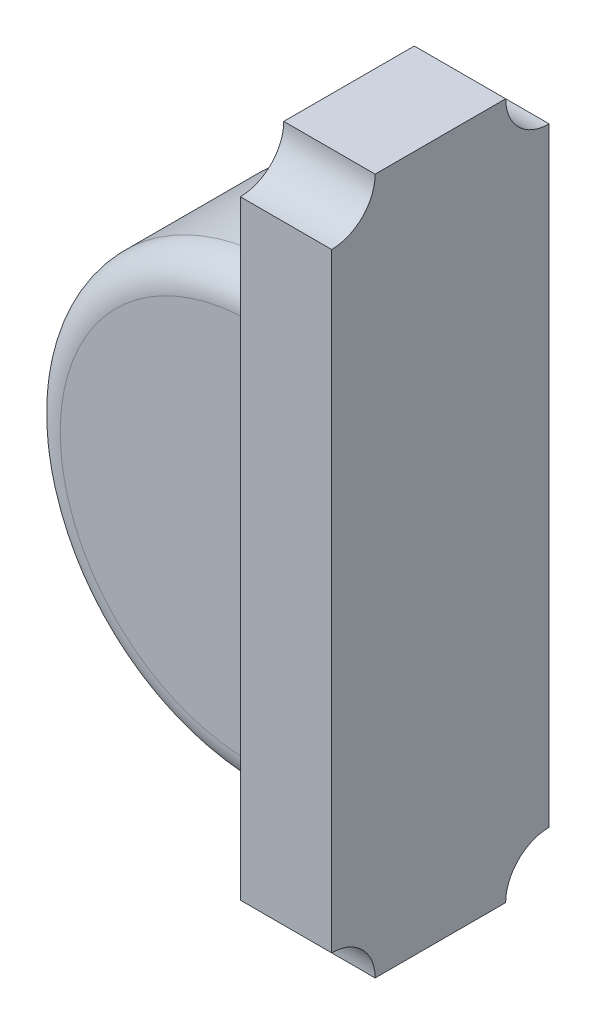
ISO-10303-21;
HEADER;
FILE_DESCRIPTION(('STEP AP214'),'2;1');
FILE_NAME('part.step','',(''),(''),'','','');
FILE_SCHEMA(('AUTOMOTIVE_DESIGN { 1 0 10303 214 1 1 1 1 }'));
ENDSEC;
DATA;
#1=APPLICATION_CONTEXT('core data for automotive mechanical design processes');
#2=APPLICATION_PROTOCOL_DEFINITION('international standard','automotive_design',2000,#1);
#3=PRODUCT_CONTEXT('',#1,'mechanical');
#4=PRODUCT('Part','Part','',(#3));
#5=PRODUCT_RELATED_PRODUCT_CATEGORY('part','',(#4));
#6=PRODUCT_DEFINITION_FORMATION('','',#4);
#7=PRODUCT_DEFINITION_CONTEXT('part definition',#1,'design');
#8=PRODUCT_DEFINITION('design','',#6,#7);
#9=PRODUCT_DEFINITION_SHAPE('','',#8);
#10=(LENGTH_UNIT() NAMED_UNIT(*) SI_UNIT(.MILLI.,.METRE.));
#11=(NAMED_UNIT(*) PLANE_ANGLE_UNIT() SI_UNIT($,.RADIAN.));
#12=(NAMED_UNIT(*) SI_UNIT($,.STERADIAN.) SOLID_ANGLE_UNIT());
#13=UNCERTAINTY_MEASURE_WITH_UNIT(LENGTH_MEASURE(1.E-05),#10,'distance_accuracy_value','');
#14=(GEOMETRIC_REPRESENTATION_CONTEXT(3) GLOBAL_UNCERTAINTY_ASSIGNED_CONTEXT((#13)) GLOBAL_UNIT_ASSIGNED_CONTEXT((#10,
#11,#12)) REPRESENTATION_CONTEXT('',''));
#15=CARTESIAN_POINT('',(0.,0.,0.));
#16=DIRECTION('',(0.,0.,1.));
#17=DIRECTION('',(1.,0.,0.));
#18=AXIS2_PLACEMENT_3D('',#15,#16,#17);
#19=CARTESIAN_POINT('',(-41.47,-15.,1.64999990463257));
#20=DIRECTION('',(0.,0.,1.));
#21=DIRECTION('',(1.,0.,0.));
#22=AXIS2_PLACEMENT_3D('',#19,#20,#21);
#23=CYLINDRICAL_SURFACE('',#22,1.02740882688236);
#24=DIRECTION('',(0.,0.,1.));
#25=VECTOR('',#24,1.);
#26=CARTESIAN_POINT('',(-41.47,-13.9725911731176,1.64999990463257));
#27=LINE('',#26,#25);
#28=CARTESIAN_POINT('',(-41.47,-13.9725911731176,1.79999990463257));
#29=VERTEX_POINT('',#28);
#30=CARTESIAN_POINT('',(-41.47,-13.9725911731176,2.39999990463257));
#31=VERTEX_POINT('',#30);
#32=EDGE_CURVE('E93',#29,#31,#27,.T.);
#33=ORIENTED_EDGE('',*,*,#32,.F.);
#34=CARTESIAN_POINT('',(-41.47,-15.,1.79999990463257));
#35=DIRECTION('',(0.,0.,1.));
#36=DIRECTION('',(1.,0.,0.));
#37=AXIS2_PLACEMENT_3D('',#34,#35,#36);
#38=CIRCLE('',#37,1.02740882688236);
#39=CARTESIAN_POINT('',(-41.47,-16.0274088268824,1.79999990463257));
#40=VERTEX_POINT('',#39);
#41=EDGE_CURVE('E103',#29,#40,#38,.T.);
#42=ORIENTED_EDGE('',*,*,#41,.T.);
#43=DIRECTION('',(0.,0.,1.));
#44=VECTOR('',#43,1.);
#45=CARTESIAN_POINT('',(-41.47,-16.0274088268824,1.64999990463257));
#46=LINE('',#45,#44);
#47=CARTESIAN_POINT('',(-41.47,-16.0274088268824,2.39999990463257));
#48=VERTEX_POINT('',#47);
#49=EDGE_CURVE('E106',#40,#48,#46,.T.);
#50=ORIENTED_EDGE('',*,*,#49,.T.);
#51=CARTESIAN_POINT('',(-41.47,-15.,2.39999990463257));
#52=DIRECTION('',(0.,0.,1.));
#53=DIRECTION('',(1.,0.,0.));
#54=AXIS2_PLACEMENT_3D('',#51,#52,#53);
#55=CIRCLE('',#54,1.02740882688236);
#56=EDGE_CURVE('E105',#48,#31,#55,.F.);
#57=ORIENTED_EDGE('',*,*,#56,.T.);
#58=EDGE_LOOP('',(#33,#42,#50,#57));
#59=FACE_BOUND('',#58,.T.);
#60=ADVANCED_FACE('F51',(#59),#23,.T.);
#61=CARTESIAN_POINT('',(-41.47,-13.9725911731176,1.64999990463257));
#62=DIRECTION('',(1.,0.,0.));
#63=DIRECTION('',(0.,0.,-1.));
#64=AXIS2_PLACEMENT_3D('',#61,#62,#63);
#65=PLANE('',#64);
#66=ORIENTED_EDGE('',*,*,#49,.F.);
#67=CARTESIAN_POINT('',(-41.47,-15.8774088268824,1.79999990463257));
#68=DIRECTION('',(1.,0.,0.));
#69=DIRECTION('',(0.,0.,-1.));
#70=AXIS2_PLACEMENT_3D('',#67,#68,#69);
#71=CIRCLE('',#70,0.15);
#72=CARTESIAN_POINT('',(-41.47,-15.8774088268824,1.64999990463257));
#73=VERTEX_POINT('',#72);
#74=EDGE_CURVE('E71',#40,#73,#71,.T.);
#75=ORIENTED_EDGE('',*,*,#74,.T.);
#76=DIRECTION('',(0.,1.,0.));
#77=VECTOR('',#76,1.);
#78=CARTESIAN_POINT('',(-41.47,-13.9725911731176,1.64999990463257));
#79=LINE('',#78,#77);
#80=CARTESIAN_POINT('',(-41.47,-14.1225911731176,1.64999990463257));
#81=VERTEX_POINT('',#80);
#82=EDGE_CURVE('E95',#73,#81,#79,.T.);
#83=ORIENTED_EDGE('',*,*,#82,.T.);
#84=CARTESIAN_POINT('',(-41.47,-14.1225911731176,1.79999990463257));
#85=DIRECTION('',(1.,0.,0.));
#86=DIRECTION('',(0.,0.,-1.));
#87=AXIS2_PLACEMENT_3D('',#84,#85,#86);
#88=CIRCLE('',#87,0.15);
#89=EDGE_CURVE('E90',#81,#29,#88,.T.);
#90=ORIENTED_EDGE('',*,*,#89,.T.);
#91=ORIENTED_EDGE('',*,*,#32,.T.);
#92=CARTESIAN_POINT('',(-41.47,-14.1225911731176,2.39999990463257));
#93=DIRECTION('',(1.,0.,0.));
#94=DIRECTION('',(0.,0.,-1.));
#95=AXIS2_PLACEMENT_3D('',#92,#93,#94);
#96=CIRCLE('',#95,0.15);
#97=CARTESIAN_POINT('',(-41.47,-14.1225911731176,2.54999990463257));
#98=VERTEX_POINT('',#97);
#99=EDGE_CURVE('E109',#31,#98,#96,.T.);
#100=ORIENTED_EDGE('',*,*,#99,.T.);
#101=DIRECTION('',(0.,1.,0.));
#102=VECTOR('',#101,1.);
#103=CARTESIAN_POINT('',(-41.47,-13.9725911731176,2.54999990463257));
#104=LINE('',#103,#102);
#105=CARTESIAN_POINT('',(-41.47,-15.8774088268824,2.54999990463257));
#106=VERTEX_POINT('',#105);
#107=EDGE_CURVE('E118',#106,#98,#104,.T.);
#108=ORIENTED_EDGE('',*,*,#107,.F.);
#109=CARTESIAN_POINT('',(-41.47,-15.8774088268824,2.39999990463257));
#110=DIRECTION('',(1.,0.,0.));
#111=DIRECTION('',(0.,0.,-1.));
#112=AXIS2_PLACEMENT_3D('',#109,#110,#111);
#113=CIRCLE('',#112,0.15);
#114=EDGE_CURVE('E98',#106,#48,#113,.T.);
#115=ORIENTED_EDGE('',*,*,#114,.T.);
#116=EDGE_LOOP('',(#66,#75,#83,#90,#91,#100,#108,#115));
#117=FACE_BOUND('',#116,.T.);
#118=ADVANCED_FACE('F92',(#117),#65,.T.);
#119=CARTESIAN_POINT('',(-41.47,-15.,1.64999990463257));
#120=DIRECTION('',(0.,0.,1.));
#121=DIRECTION('',(1.,0.,0.));
#122=AXIS2_PLACEMENT_3D('',#119,#120,#121);
#123=PLANE('',#122);
#124=ORIENTED_EDGE('',*,*,#82,.F.);
#125=CARTESIAN_POINT('',(-41.47,-15.,1.64999990463257));
#126=DIRECTION('',(0.,0.,1.));
#127=DIRECTION('',(1.,0.,0.));
#128=AXIS2_PLACEMENT_3D('',#125,#126,#127);
#129=CIRCLE('',#128,0.877408826882362);
#130=EDGE_CURVE('E59',#73,#81,#129,.F.);
#131=ORIENTED_EDGE('',*,*,#130,.T.);
#132=EDGE_LOOP('',(#124,#131));
#133=FACE_BOUND('',#132,.T.);
#134=ADVANCED_FACE('F126',(#133),#123,.F.);
#135=CARTESIAN_POINT('',(-41.47,-15.,2.54999990463257));
#136=DIRECTION('',(0.,0.,1.));
#137=DIRECTION('',(1.,0.,0.));
#138=AXIS2_PLACEMENT_3D('',#135,#136,#137);
#139=PLANE('',#138);
#140=ORIENTED_EDGE('',*,*,#107,.T.);
#141=CARTESIAN_POINT('',(-41.47,-15.,2.54999990463257));
#142=DIRECTION('',(0.,0.,1.));
#143=DIRECTION('',(1.,0.,0.));
#144=AXIS2_PLACEMENT_3D('',#141,#142,#143);
#145=CIRCLE('',#144,0.877408826882362);
#146=EDGE_CURVE('E12',#98,#106,#145,.T.);
#147=ORIENTED_EDGE('',*,*,#146,.T.);
#148=EDGE_LOOP('',(#140,#147));
#149=FACE_BOUND('',#148,.T.);
#150=ADVANCED_FACE('F122',(#149),#139,.T.);
#151=CARTESIAN_POINT('',(-41.47,-15.,1.79999990463257));
#152=DIRECTION('',(0.,0.,1.));
#153=DIRECTION('',(1.,0.,0.));
#154=AXIS2_PLACEMENT_3D('',#151,#152,#153);
#155=TOROIDAL_SURFACE('',#154,0.877408826882362,0.15);
#156=ORIENTED_EDGE('',*,*,#89,.F.);
#157=ORIENTED_EDGE('',*,*,#130,.F.);
#158=ORIENTED_EDGE('',*,*,#74,.F.);
#159=ORIENTED_EDGE('',*,*,#41,.F.);
#160=EDGE_LOOP('',(#156,#157,#158,#159));
#161=FACE_BOUND('',#160,.T.);
#162=ADVANCED_FACE('F108',(#161),#155,.T.);
#163=CARTESIAN_POINT('',(-41.47,-15.,2.39999990463257));
#164=DIRECTION('',(0.,0.,1.));
#165=DIRECTION('',(1.,0.,0.));
#166=AXIS2_PLACEMENT_3D('',#163,#164,#165);
#167=TOROIDAL_SURFACE('',#166,0.877408826882362,0.15);
#168=ORIENTED_EDGE('',*,*,#99,.F.);
#169=ORIENTED_EDGE('',*,*,#56,.F.);
#170=ORIENTED_EDGE('',*,*,#114,.F.);
#171=ORIENTED_EDGE('',*,*,#146,.F.);
#172=EDGE_LOOP('',(#168,#169,#170,#171));
#173=FACE_BOUND('',#172,.T.);
#174=ADVANCED_FACE('F53',(#173),#167,.T.);
#175=CLOSED_SHELL('',(#60,#118,#134,#150,#162,#174));
#176=MANIFOLD_SOLID_BREP('B2',#175);
#177=CARTESIAN_POINT('',(-41.47,-13.4000005722023,2.59999990463257));
#178=DIRECTION('',(1.,0.,0.));
#179=DIRECTION('',(0.,0.,-1.));
#180=AXIS2_PLACEMENT_3D('',#177,#178,#179);
#181=CYLINDRICAL_SURFACE('',#180,0.199999809267411);
#182=CARTESIAN_POINT('',(-41.05,-13.4000005722023,2.59999990463257));
#183=DIRECTION('',(-1.,0.,0.));
#184=DIRECTION('',(0.,0.,-1.));
#185=AXIS2_PLACEMENT_3D('',#182,#183,#184);
#186=CIRCLE('',#185,0.199999809267411);
#187=CARTESIAN_POINT('',(-41.05,-13.3999996185303,2.40000009536743));
#188=VERTEX_POINT('',#187);
#189=CARTESIAN_POINT('',(-41.05,-13.6000003814697,2.59999990463257));
#190=VERTEX_POINT('',#189);
#191=EDGE_CURVE('E284',#188,#190,#186,.T.);
#192=ORIENTED_EDGE('',*,*,#191,.F.);
#193=DIRECTION('',(1.,0.,0.));
#194=VECTOR('',#193,1.);
#195=CARTESIAN_POINT('',(-41.47,-13.3999996185303,2.40000009536743));
#196=LINE('',#195,#194);
#197=CARTESIAN_POINT('',(-41.47,-13.3999996185303,2.40000009536743));
#198=VERTEX_POINT('',#197);
#199=EDGE_CURVE('E49',#198,#188,#196,.T.);
#200=ORIENTED_EDGE('',*,*,#199,.F.);
#201=CARTESIAN_POINT('',(-41.47,-13.4000005722023,2.59999990463257));
#202=DIRECTION('',(-1.,0.,0.));
#203=DIRECTION('',(0.,0.,-1.));
#204=AXIS2_PLACEMENT_3D('',#201,#202,#203);
#205=CIRCLE('',#204,0.199999809267411);
#206=CARTESIAN_POINT('',(-41.47,-13.6000003814697,2.59999990463257));
#207=VERTEX_POINT('',#206);
#208=EDGE_CURVE('E304',#198,#207,#205,.T.);
#209=ORIENTED_EDGE('',*,*,#208,.T.);
#210=DIRECTION('',(1.,0.,0.));
#211=VECTOR('',#210,1.);
#212=CARTESIAN_POINT('',(-41.47,-13.6000003814697,2.59999990463257));
#213=LINE('',#212,#211);
#214=EDGE_CURVE('E190',#207,#190,#213,.T.);
#215=ORIENTED_EDGE('',*,*,#214,.T.);
#216=EDGE_LOOP('',(#192,#200,#209,#215));
#217=FACE_BOUND('',#216,.T.);
#218=ADVANCED_FACE('F187',(#217),#181,.F.);
#219=CARTESIAN_POINT('',(-41.47,-13.3999996185303,2.40000009536743));
#220=DIRECTION('',(0.,1.,0.));
#221=DIRECTION('',(0.,0.,1.));
#222=AXIS2_PLACEMENT_3D('',#219,#220,#221);
#223=PLANE('',#222);
#224=DIRECTION('',(0.,0.,1.));
#225=VECTOR('',#224,1.);
#226=CARTESIAN_POINT('',(-41.05,-13.3999996185303,2.40000009536743));
#227=LINE('',#226,#225);
#228=CARTESIAN_POINT('',(-41.05,-13.3999996185303,1.79999995231628));
#229=VERTEX_POINT('',#228);
#230=EDGE_CURVE('E302',#229,#188,#227,.T.);
#231=ORIENTED_EDGE('',*,*,#230,.F.);
#232=DIRECTION('',(1.,0.,0.));
#233=VECTOR('',#232,1.);
#234=CARTESIAN_POINT('',(-41.47,-13.3999996185303,1.79999995231628));
#235=LINE('',#234,#233);
#236=CARTESIAN_POINT('',(-41.47,-13.3999996185303,1.79999995231628));
#237=VERTEX_POINT('',#236);
#238=EDGE_CURVE('E196',#237,#229,#235,.T.);
#239=ORIENTED_EDGE('',*,*,#238,.F.);
#240=DIRECTION('',(0.,0.,1.));
#241=VECTOR('',#240,1.);
#242=CARTESIAN_POINT('',(-41.47,-13.3999996185303,2.40000009536743));
#243=LINE('',#242,#241);
#244=EDGE_CURVE('E274',#237,#198,#243,.T.);
#245=ORIENTED_EDGE('',*,*,#244,.T.);
#246=ORIENTED_EDGE('',*,*,#199,.T.);
#247=EDGE_LOOP('',(#231,#239,#245,#246));
#248=FACE_BOUND('',#247,.T.);
#249=ADVANCED_FACE('F316',(#248),#223,.T.);
#250=CARTESIAN_POINT('',(-41.47,-13.3999996185303,1.59999918937509));
#251=DIRECTION('',(1.,0.,0.));
#252=DIRECTION('',(0.,0.,-1.));
#253=AXIS2_PLACEMENT_3D('',#250,#251,#252);
#254=CYLINDRICAL_SURFACE('',#253,0.200000762941194);
#255=CARTESIAN_POINT('',(-41.05,-13.3999996185303,1.59999918937509));
#256=DIRECTION('',(-1.,0.,0.));
#257=DIRECTION('',(0.,0.,-1.));
#258=AXIS2_PLACEMENT_3D('',#255,#256,#257);
#259=CIRCLE('',#258,0.200000762941194);
#260=CARTESIAN_POINT('',(-41.05,-13.6000003814697,1.60000002384186));
#261=VERTEX_POINT('',#260);
#262=EDGE_CURVE('E261',#261,#229,#259,.T.);
#263=ORIENTED_EDGE('',*,*,#262,.F.);
#264=DIRECTION('',(1.,0.,0.));
#265=VECTOR('',#264,1.);
#266=CARTESIAN_POINT('',(-41.47,-13.6000003814697,1.60000002384186));
#267=LINE('',#266,#265);
#268=CARTESIAN_POINT('',(-41.47,-13.6000003814697,1.60000002384186));
#269=VERTEX_POINT('',#268);
#270=EDGE_CURVE('E256',#269,#261,#267,.T.);
#271=ORIENTED_EDGE('',*,*,#270,.F.);
#272=CARTESIAN_POINT('',(-41.47,-13.3999996185303,1.59999918937509));
#273=DIRECTION('',(-1.,0.,0.));
#274=DIRECTION('',(0.,0.,-1.));
#275=AXIS2_PLACEMENT_3D('',#272,#273,#274);
#276=CIRCLE('',#275,0.200000762941194);
#277=EDGE_CURVE('E259',#269,#237,#276,.T.);
#278=ORIENTED_EDGE('',*,*,#277,.T.);
#279=ORIENTED_EDGE('',*,*,#238,.T.);
#280=EDGE_LOOP('',(#263,#271,#278,#279));
#281=FACE_BOUND('',#280,.T.);
#282=ADVANCED_FACE('F258',(#281),#254,.F.);
#283=CARTESIAN_POINT('',(-41.47,-13.6000003814697,1.60000002384186));
#284=DIRECTION('',(0.,0.,-1.));
#285=DIRECTION('',(-1.,0.,0.));
#286=AXIS2_PLACEMENT_3D('',#283,#284,#285);
#287=PLANE('',#286);
#288=DIRECTION('',(0.,1.,0.));
#289=VECTOR('',#288,1.);
#290=CARTESIAN_POINT('',(-41.05,-13.6000003814697,1.60000002384186));
#291=LINE('',#290,#289);
#292=CARTESIAN_POINT('',(-41.05,-16.3999996185303,1.60000002384186));
#293=VERTEX_POINT('',#292);
#294=EDGE_CURVE('E299',#293,#261,#291,.T.);
#295=ORIENTED_EDGE('',*,*,#294,.F.);
#296=DIRECTION('',(1.,0.,0.));
#297=VECTOR('',#296,1.);
#298=CARTESIAN_POINT('',(-41.47,-16.3999996185303,1.60000002384186));
#299=LINE('',#298,#297);
#300=CARTESIAN_POINT('',(-41.47,-16.3999996185303,1.60000002384186));
#301=VERTEX_POINT('',#300);
#302=EDGE_CURVE('E266',#301,#293,#299,.T.);
#303=ORIENTED_EDGE('',*,*,#302,.F.);
#304=DIRECTION('',(0.,1.,0.));
#305=VECTOR('',#304,1.);
#306=CARTESIAN_POINT('',(-41.47,-13.6000003814697,1.60000002384186));
#307=LINE('',#306,#305);
#308=EDGE_CURVE('E272',#301,#269,#307,.T.);
#309=ORIENTED_EDGE('',*,*,#308,.T.);
#310=ORIENTED_EDGE('',*,*,#270,.T.);
#311=EDGE_LOOP('',(#295,#303,#309,#310));
#312=FACE_BOUND('',#311,.T.);
#313=ADVANCED_FACE('F276',(#312),#287,.T.);
#314=CARTESIAN_POINT('',(-41.47,-16.5999995470064,1.60000002384186));
#315=DIRECTION('',(1.,0.,0.));
#316=DIRECTION('',(0.,0.,-1.));
#317=AXIS2_PLACEMENT_3D('',#314,#315,#316);
#318=CYLINDRICAL_SURFACE('',#317,0.199999928476167);
#319=CARTESIAN_POINT('',(-41.05,-16.5999995470064,1.60000002384186));
#320=DIRECTION('',(-1.,0.,0.));
#321=DIRECTION('',(0.,0.,-1.));
#322=AXIS2_PLACEMENT_3D('',#319,#320,#321);
#323=CIRCLE('',#322,0.199999928476167);
#324=CARTESIAN_POINT('',(-41.05,-16.6000003814697,1.79999995231628));
#325=VERTEX_POINT('',#324);
#326=EDGE_CURVE('E296',#325,#293,#323,.T.);
#327=ORIENTED_EDGE('',*,*,#326,.F.);
#328=DIRECTION('',(1.,0.,0.));
#329=VECTOR('',#328,1.);
#330=CARTESIAN_POINT('',(-41.47,-16.6000003814697,1.79999995231628));
#331=LINE('',#330,#329);
#332=CARTESIAN_POINT('',(-41.47,-16.6000003814697,1.79999995231628));
#333=VERTEX_POINT('',#332);
#334=EDGE_CURVE('E308',#333,#325,#331,.T.);
#335=ORIENTED_EDGE('',*,*,#334,.F.);
#336=CARTESIAN_POINT('',(-41.47,-16.5999995470064,1.60000002384186));
#337=DIRECTION('',(-1.,0.,0.));
#338=DIRECTION('',(0.,0.,-1.));
#339=AXIS2_PLACEMENT_3D('',#336,#337,#338);
#340=CIRCLE('',#339,0.199999928476167);
#341=EDGE_CURVE('E277',#333,#301,#340,.T.);
#342=ORIENTED_EDGE('',*,*,#341,.T.);
#343=ORIENTED_EDGE('',*,*,#302,.T.);
#344=EDGE_LOOP('',(#327,#335,#342,#343));
#345=FACE_BOUND('',#344,.T.);
#346=ADVANCED_FACE('F329',(#345),#318,.F.);
#347=CARTESIAN_POINT('',(-41.47,-16.6000003814697,2.40000009536743));
#348=DIRECTION('',(0.,-1.,0.));
#349=DIRECTION('',(0.,0.,-1.));
#350=AXIS2_PLACEMENT_3D('',#347,#348,#349);
#351=PLANE('',#350);
#352=DIRECTION('',(0.,0.,-1.));
#353=VECTOR('',#352,1.);
#354=CARTESIAN_POINT('',(-41.05,-16.6000003814697,2.40000009536743));
#355=LINE('',#354,#353);
#356=CARTESIAN_POINT('',(-41.05,-16.6000003814697,2.40000009536743));
#357=VERTEX_POINT('',#356);
#358=EDGE_CURVE('E293',#357,#325,#355,.T.);
#359=ORIENTED_EDGE('',*,*,#358,.F.);
#360=DIRECTION('',(1.,0.,0.));
#361=VECTOR('',#360,1.);
#362=CARTESIAN_POINT('',(-41.47,-16.6000003814697,2.40000009536743));
#363=LINE('',#362,#361);
#364=CARTESIAN_POINT('',(-41.47,-16.6000003814697,2.40000009536743));
#365=VERTEX_POINT('',#364);
#366=EDGE_CURVE('E310',#365,#357,#363,.T.);
#367=ORIENTED_EDGE('',*,*,#366,.F.);
#368=DIRECTION('',(0.,0.,-1.));
#369=VECTOR('',#368,1.);
#370=CARTESIAN_POINT('',(-41.47,-16.6000003814697,2.40000009536743));
#371=LINE('',#370,#369);
#372=EDGE_CURVE('E279',#365,#333,#371,.T.);
#373=ORIENTED_EDGE('',*,*,#372,.T.);
#374=ORIENTED_EDGE('',*,*,#334,.T.);
#375=EDGE_LOOP('',(#359,#367,#373,#374));
#376=FACE_BOUND('',#375,.T.);
#377=ADVANCED_FACE('F332',(#376),#351,.T.);
#378=CARTESIAN_POINT('',(-41.47,-16.5999994277977,2.59999990463257));
#379=DIRECTION('',(1.,0.,0.));
#380=DIRECTION('',(0.,0.,-1.));
#381=AXIS2_PLACEMENT_3D('',#378,#379,#380);
#382=CYLINDRICAL_SURFACE('',#381,0.19999980926741);
#383=CARTESIAN_POINT('',(-41.05,-16.5999994277977,2.59999990463257));
#384=DIRECTION('',(-1.,0.,0.));
#385=DIRECTION('',(0.,0.,1.));
#386=AXIS2_PLACEMENT_3D('',#383,#384,#385);
#387=CIRCLE('',#386,0.19999980926741);
#388=CARTESIAN_POINT('',(-41.05,-16.3999996185303,2.59999990463257));
#389=VERTEX_POINT('',#388);
#390=EDGE_CURVE('E290',#389,#357,#387,.T.);
#391=ORIENTED_EDGE('',*,*,#390,.F.);
#392=DIRECTION('',(1.,0.,0.));
#393=VECTOR('',#392,1.);
#394=CARTESIAN_POINT('',(-41.47,-16.3999996185303,2.59999990463257));
#395=LINE('',#394,#393);
#396=CARTESIAN_POINT('',(-41.47,-16.3999996185303,2.59999990463257));
#397=VERTEX_POINT('',#396);
#398=EDGE_CURVE('E311',#397,#389,#395,.T.);
#399=ORIENTED_EDGE('',*,*,#398,.F.);
#400=CARTESIAN_POINT('',(-41.47,-16.5999994277977,2.59999990463257));
#401=DIRECTION('',(-1.,0.,0.));
#402=DIRECTION('',(0.,0.,1.));
#403=AXIS2_PLACEMENT_3D('',#400,#401,#402);
#404=CIRCLE('',#403,0.19999980926741);
#405=EDGE_CURVE('E427',#397,#365,#404,.T.);
#406=ORIENTED_EDGE('',*,*,#405,.T.);
#407=ORIENTED_EDGE('',*,*,#366,.T.);
#408=EDGE_LOOP('',(#391,#399,#406,#407));
#409=FACE_BOUND('',#408,.T.);
#410=ADVANCED_FACE('F336',(#409),#382,.F.);
#411=CARTESIAN_POINT('',(-41.47,-16.3999996185303,2.59999990463257));
#412=DIRECTION('',(0.,0.,1.));
#413=DIRECTION('',(1.,0.,0.));
#414=AXIS2_PLACEMENT_3D('',#411,#412,#413);
#415=PLANE('',#414);
#416=DIRECTION('',(0.,-1.,0.));
#417=VECTOR('',#416,1.);
#418=CARTESIAN_POINT('',(-41.05,-16.3999996185303,2.59999990463257));
#419=LINE('',#418,#417);
#420=EDGE_CURVE('E287',#190,#389,#419,.T.);
#421=ORIENTED_EDGE('',*,*,#420,.F.);
#422=ORIENTED_EDGE('',*,*,#214,.F.);
#423=DIRECTION('',(0.,-1.,0.));
#424=VECTOR('',#423,1.);
#425=CARTESIAN_POINT('',(-41.47,-16.3999996185303,2.59999990463257));
#426=LINE('',#425,#424);
#427=EDGE_CURVE('E428',#207,#397,#426,.T.);
#428=ORIENTED_EDGE('',*,*,#427,.T.);
#429=ORIENTED_EDGE('',*,*,#398,.T.);
#430=EDGE_LOOP('',(#421,#422,#428,#429));
#431=FACE_BOUND('',#430,.T.);
#432=ADVANCED_FACE('F313',(#431),#415,.T.);
#433=CARTESIAN_POINT('',(-41.47,-13.4000005722023,2.59999990463257));
#434=DIRECTION('',(1.,0.,0.));
#435=DIRECTION('',(0.,0.,-1.));
#436=AXIS2_PLACEMENT_3D('',#433,#434,#435);
#437=PLANE('',#436);
#438=ORIENTED_EDGE('',*,*,#208,.F.);
#439=ORIENTED_EDGE('',*,*,#244,.F.);
#440=ORIENTED_EDGE('',*,*,#277,.F.);
#441=ORIENTED_EDGE('',*,*,#308,.F.);
#442=ORIENTED_EDGE('',*,*,#341,.F.);
#443=ORIENTED_EDGE('',*,*,#372,.F.);
#444=ORIENTED_EDGE('',*,*,#405,.F.);
#445=ORIENTED_EDGE('',*,*,#427,.F.);
#446=EDGE_LOOP('',(#438,#439,#440,#441,#442,#443,#444,#445));
#447=FACE_BOUND('',#446,.T.);
#448=ADVANCED_FACE('F270',(#447),#437,.F.);
#449=CARTESIAN_POINT('',(-41.05,-13.4000005722023,2.59999990463257));
#450=DIRECTION('',(1.,0.,0.));
#451=DIRECTION('',(0.,0.,-1.));
#452=AXIS2_PLACEMENT_3D('',#449,#450,#451);
#453=PLANE('',#452);
#454=ORIENTED_EDGE('',*,*,#191,.T.);
#455=ORIENTED_EDGE('',*,*,#420,.T.);
#456=ORIENTED_EDGE('',*,*,#390,.T.);
#457=ORIENTED_EDGE('',*,*,#358,.T.);
#458=ORIENTED_EDGE('',*,*,#326,.T.);
#459=ORIENTED_EDGE('',*,*,#294,.T.);
#460=ORIENTED_EDGE('',*,*,#262,.T.);
#461=ORIENTED_EDGE('',*,*,#230,.T.);
#462=EDGE_LOOP('',(#454,#455,#456,#457,#458,#459,#460,#461));
#463=FACE_BOUND('',#462,.T.);
#464=ADVANCED_FACE('F315',(#463),#453,.T.);
#465=CLOSED_SHELL('',(#218,#249,#282,#313,#346,#377,#410,#432,#448,#464));
#466=MANIFOLD_SOLID_BREP('B6',#465);
#467=ADVANCED_BREP_SHAPE_REPRESENTATION('',(#18,#176,#466),#14);
#468=SHAPE_DEFINITION_REPRESENTATION(#9,#467);
ENDSEC;
END-ISO-10303-21;
